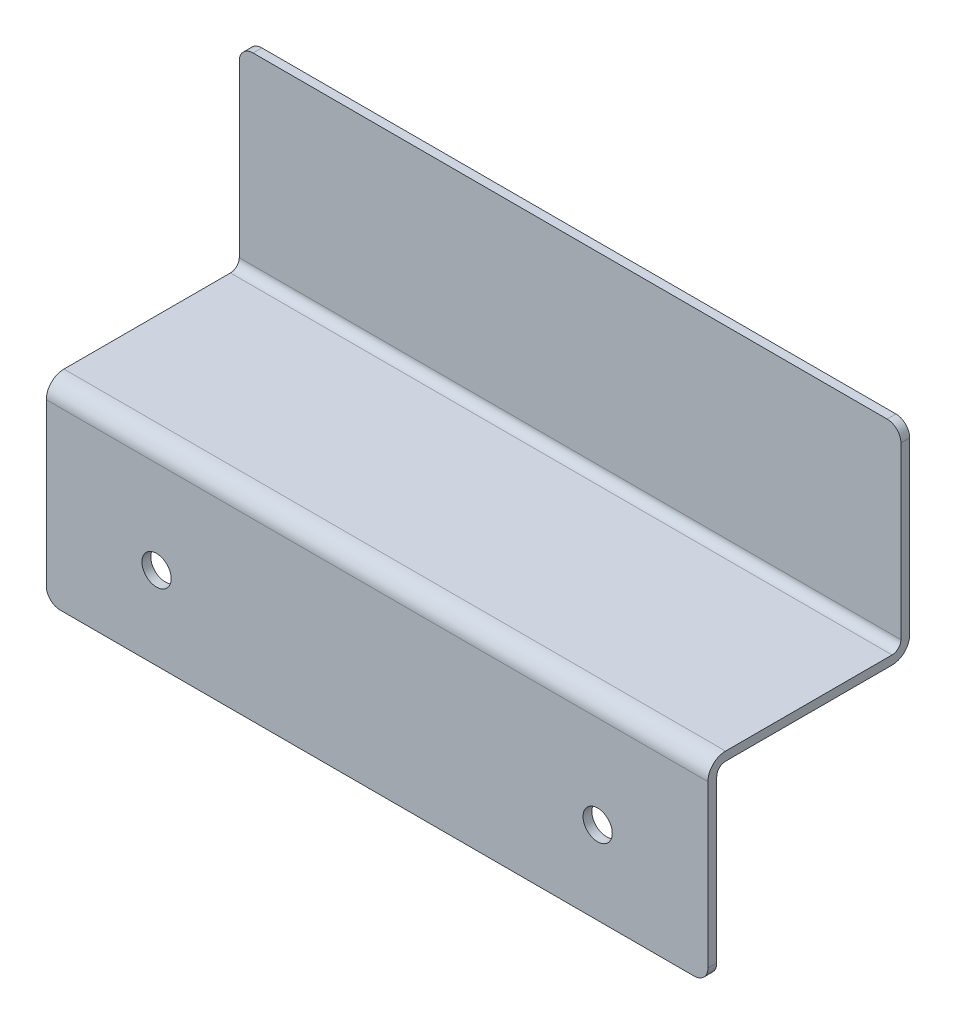
ISO-10303-21;
HEADER;
FILE_DESCRIPTION(('STEP AP214'),'2;1');
FILE_NAME('part.step','',(''),(''),'','','');
FILE_SCHEMA(('AUTOMOTIVE_DESIGN { 1 0 10303 214 1 1 1 1 }'));
ENDSEC;
DATA;
#1=APPLICATION_CONTEXT('core data for automotive mechanical design processes');
#2=APPLICATION_PROTOCOL_DEFINITION('international standard','automotive_design',2000,#1);
#3=PRODUCT_CONTEXT('',#1,'mechanical');
#4=PRODUCT('Part','Part','',(#3));
#5=PRODUCT_RELATED_PRODUCT_CATEGORY('part','',(#4));
#6=PRODUCT_DEFINITION_FORMATION('','',#4);
#7=PRODUCT_DEFINITION_CONTEXT('part definition',#1,'design');
#8=PRODUCT_DEFINITION('design','',#6,#7);
#9=PRODUCT_DEFINITION_SHAPE('','',#8);
#10=(LENGTH_UNIT() NAMED_UNIT(*) SI_UNIT(.MILLI.,.METRE.));
#11=(NAMED_UNIT(*) PLANE_ANGLE_UNIT() SI_UNIT($,.RADIAN.));
#12=(NAMED_UNIT(*) SI_UNIT($,.STERADIAN.) SOLID_ANGLE_UNIT());
#13=UNCERTAINTY_MEASURE_WITH_UNIT(LENGTH_MEASURE(1.E-05),#10,'distance_accuracy_value','');
#14=(GEOMETRIC_REPRESENTATION_CONTEXT(3) GLOBAL_UNCERTAINTY_ASSIGNED_CONTEXT((#13)) GLOBAL_UNIT_ASSIGNED_CONTEXT((#10,
#11,#12)) REPRESENTATION_CONTEXT('',''));
#15=CARTESIAN_POINT('',(0.,0.,0.));
#16=DIRECTION('',(0.,0.,1.));
#17=DIRECTION('',(1.,0.,0.));
#18=AXIS2_PLACEMENT_3D('',#15,#16,#17);
#19=CARTESIAN_POINT('',(152.4,0.,0.));
#20=DIRECTION('',(0.,-1.,0.));
#21=DIRECTION('',(0.,0.,-1.));
#22=AXIS2_PLACEMENT_3D('',#19,#20,#21);
#23=PLANE('',#22);
#24=DIRECTION('',(-1.,0.,0.));
#25=VECTOR('',#24,1.);
#26=CARTESIAN_POINT('',(152.4,0.,-2.032));
#27=LINE('',#26,#25);
#28=CARTESIAN_POINT('',(149.225,0.,-2.032));
#29=VERTEX_POINT('',#28);
#30=CARTESIAN_POINT('',(3.17500000000007,0.,-2.032));
#31=VERTEX_POINT('',#30);
#32=EDGE_CURVE('E189',#29,#31,#27,.T.);
#33=ORIENTED_EDGE('',*,*,#32,.T.);
#34=DIRECTION('',(0.,0.,1.));
#35=VECTOR('',#34,1.);
#36=CARTESIAN_POINT('',(3.17500000000001,0.,0.));
#37=LINE('',#36,#35);
#38=CARTESIAN_POINT('',(3.17500000000007,0.,0.));
#39=VERTEX_POINT('',#38);
#40=EDGE_CURVE('E249',#31,#39,#37,.T.);
#41=ORIENTED_EDGE('',*,*,#40,.T.);
#42=DIRECTION('',(-1.,0.,0.));
#43=VECTOR('',#42,1.);
#44=CARTESIAN_POINT('',(152.4,0.,0.));
#45=LINE('',#44,#43);
#46=CARTESIAN_POINT('',(149.225,0.,0.));
#47=VERTEX_POINT('',#46);
#48=EDGE_CURVE('E174',#47,#39,#45,.T.);
#49=ORIENTED_EDGE('',*,*,#48,.F.);
#50=DIRECTION('',(0.,0.,1.));
#51=VECTOR('',#50,1.);
#52=CARTESIAN_POINT('',(149.225,0.,0.));
#53=LINE('',#52,#51);
#54=EDGE_CURVE('E247',#47,#29,#53,.F.);
#55=ORIENTED_EDGE('',*,*,#54,.T.);
#56=EDGE_LOOP('',(#33,#41,#49,#55));
#57=FACE_BOUND('',#56,.T.);
#58=ADVANCED_FACE('F34',(#57),#23,.F.);
#59=CARTESIAN_POINT('',(152.4,0.,0.));
#60=DIRECTION('',(0.,0.,-1.));
#61=DIRECTION('',(0.,1.,0.));
#62=AXIS2_PLACEMENT_3D('',#59,#60,#61);
#63=PLANE('',#62);
#64=ORIENTED_EDGE('',*,*,#48,.T.);
#65=CARTESIAN_POINT('',(3.17500000000001,-3.175,0.));
#66=DIRECTION('',(0.,0.,-1.));
#67=DIRECTION('',(0.,1.,0.));
#68=AXIS2_PLACEMENT_3D('',#65,#66,#67);
#69=CIRCLE('',#68,3.175);
#70=CARTESIAN_POINT('',(0.,-3.175,0.));
#71=VERTEX_POINT('',#70);
#72=EDGE_CURVE('E253',#39,#71,#69,.F.);
#73=ORIENTED_EDGE('',*,*,#72,.T.);
#74=DIRECTION('',(0.,-1.,0.));
#75=VECTOR('',#74,1.);
#76=CARTESIAN_POINT('',(0.,0.,0.));
#77=LINE('',#76,#75);
#78=CARTESIAN_POINT('',(0.,-42.418,0.));
#79=VERTEX_POINT('',#78);
#80=EDGE_CURVE('E264',#71,#79,#77,.T.);
#81=ORIENTED_EDGE('',*,*,#80,.T.);
#82=DIRECTION('',(-1.,0.,0.));
#83=VECTOR('',#82,1.);
#84=CARTESIAN_POINT('',(152.4,-42.418,0.));
#85=LINE('',#84,#83);
#86=CARTESIAN_POINT('',(152.4,-42.418,0.));
#87=VERTEX_POINT('',#86);
#88=EDGE_CURVE('E164',#79,#87,#85,.F.);
#89=ORIENTED_EDGE('',*,*,#88,.T.);
#90=DIRECTION('',(0.,-1.,0.));
#91=VECTOR('',#90,1.);
#92=CARTESIAN_POINT('',(152.4,0.,0.));
#93=LINE('',#92,#91);
#94=CARTESIAN_POINT('',(152.4,-3.175,0.));
#95=VERTEX_POINT('',#94);
#96=EDGE_CURVE('E183',#95,#87,#93,.T.);
#97=ORIENTED_EDGE('',*,*,#96,.F.);
#98=CARTESIAN_POINT('',(149.225,-3.175,0.));
#99=DIRECTION('',(0.,0.,-1.));
#100=DIRECTION('',(0.,1.,0.));
#101=AXIS2_PLACEMENT_3D('',#98,#99,#100);
#102=CIRCLE('',#101,3.175);
#103=EDGE_CURVE('E59',#95,#47,#102,.F.);
#104=ORIENTED_EDGE('',*,*,#103,.T.);
#105=EDGE_LOOP('',(#64,#73,#81,#89,#97,#104));
#106=FACE_BOUND('',#105,.T.);
#107=ADVANCED_FACE('F336',(#106),#63,.F.);
#108=CARTESIAN_POINT('',(152.4,-44.45,0.));
#109=DIRECTION('',(0.,-1.,0.));
#110=DIRECTION('',(0.,0.,-1.));
#111=AXIS2_PLACEMENT_3D('',#108,#109,#110);
#112=PLANE('',#111);
#113=DIRECTION('',(0.,0.,1.));
#114=VECTOR('',#113,1.);
#115=CARTESIAN_POINT('',(0.,-44.45,0.));
#116=LINE('',#115,#114);
#117=CARTESIAN_POINT('',(0.,-44.45,2.03199999999999));
#118=VERTEX_POINT('',#117);
#119=CARTESIAN_POINT('',(0.,-44.45,40.386));
#120=VERTEX_POINT('',#119);
#121=EDGE_CURVE('E285',#118,#120,#116,.T.);
#122=ORIENTED_EDGE('',*,*,#121,.T.);
#123=DIRECTION('',(-1.,0.,0.));
#124=VECTOR('',#123,1.);
#125=CARTESIAN_POINT('',(152.4,-44.45,40.386));
#126=LINE('',#125,#124);
#127=CARTESIAN_POINT('',(152.4,-44.45,40.386));
#128=VERTEX_POINT('',#127);
#129=EDGE_CURVE('E219',#120,#128,#126,.F.);
#130=ORIENTED_EDGE('',*,*,#129,.T.);
#131=DIRECTION('',(0.,0.,1.));
#132=VECTOR('',#131,1.);
#133=CARTESIAN_POINT('',(152.4,-44.45,0.));
#134=LINE('',#133,#132);
#135=CARTESIAN_POINT('',(152.4,-44.45,2.03199999999999));
#136=VERTEX_POINT('',#135);
#137=EDGE_CURVE('E274',#136,#128,#134,.T.);
#138=ORIENTED_EDGE('',*,*,#137,.F.);
#139=DIRECTION('',(-1.,0.,0.));
#140=VECTOR('',#139,1.);
#141=CARTESIAN_POINT('',(0.,-44.45,2.03199999999999));
#142=LINE('',#141,#140);
#143=EDGE_CURVE('E202',#136,#118,#142,.T.);
#144=ORIENTED_EDGE('',*,*,#143,.T.);
#145=EDGE_LOOP('',(#122,#130,#138,#144));
#146=FACE_BOUND('',#145,.T.);
#147=ADVANCED_FACE('F318',(#146),#112,.F.);
#148=CARTESIAN_POINT('',(152.4,-44.45,44.45));
#149=DIRECTION('',(0.,0.,-1.));
#150=DIRECTION('',(0.,1.,0.));
#151=AXIS2_PLACEMENT_3D('',#148,#149,#150);
#152=PLANE('',#151);
#153=CARTESIAN_POINT('',(25.4,-69.85,44.45));
#154=DIRECTION('',(0.,0.,1.));
#155=DIRECTION('',(1.,0.,0.));
#156=AXIS2_PLACEMENT_3D('',#153,#154,#155);
#157=CIRCLE('',#156,3.3655);
#158=CARTESIAN_POINT('',(28.7655,-69.85,44.45));
#159=VERTEX_POINT('',#158);
#160=EDGE_CURVE('E260',#159,#159,#157,.T.);
#161=ORIENTED_EDGE('',*,*,#160,.F.);
#162=EDGE_LOOP('',(#161));
#163=FACE_BOUND('',#162,.T.);
#164=CARTESIAN_POINT('',(127.,-69.85,44.45));
#165=DIRECTION('',(0.,0.,1.));
#166=DIRECTION('',(1.,0.,0.));
#167=AXIS2_PLACEMENT_3D('',#164,#165,#166);
#168=CIRCLE('',#167,3.36549999999999);
#169=CARTESIAN_POINT('',(130.3655,-69.85,44.45));
#170=VERTEX_POINT('',#169);
#171=EDGE_CURVE('E266',#170,#170,#168,.T.);
#172=ORIENTED_EDGE('',*,*,#171,.F.);
#173=EDGE_LOOP('',(#172));
#174=FACE_BOUND('',#173,.T.);
#175=DIRECTION('',(0.,-1.,0.));
#176=VECTOR('',#175,1.);
#177=CARTESIAN_POINT('',(0.,-44.45,44.45));
#178=LINE('',#177,#176);
#179=CARTESIAN_POINT('',(0.,-48.514,44.45));
#180=VERTEX_POINT('',#179);
#181=CARTESIAN_POINT('',(0.,-85.725,44.45));
#182=VERTEX_POINT('',#181);
#183=EDGE_CURVE('E185',#180,#182,#178,.T.);
#184=ORIENTED_EDGE('',*,*,#183,.T.);
#185=CARTESIAN_POINT('',(3.17500000000001,-85.725,44.45));
#186=DIRECTION('',(0.,0.,-1.));
#187=DIRECTION('',(0.,1.,0.));
#188=AXIS2_PLACEMENT_3D('',#185,#186,#187);
#189=CIRCLE('',#188,3.175);
#190=CARTESIAN_POINT('',(3.17500000000007,-88.9,44.45));
#191=VERTEX_POINT('',#190);
#192=EDGE_CURVE('E245',#182,#191,#189,.F.);
#193=ORIENTED_EDGE('',*,*,#192,.T.);
#194=DIRECTION('',(-1.,0.,0.));
#195=VECTOR('',#194,1.);
#196=CARTESIAN_POINT('',(152.4,-88.9,44.45));
#197=LINE('',#196,#195);
#198=CARTESIAN_POINT('',(149.225,-88.9,44.45));
#199=VERTEX_POINT('',#198);
#200=EDGE_CURVE('E196',#199,#191,#197,.T.);
#201=ORIENTED_EDGE('',*,*,#200,.F.);
#202=CARTESIAN_POINT('',(149.225,-85.725,44.45));
#203=DIRECTION('',(0.,0.,-1.));
#204=DIRECTION('',(0.,1.,0.));
#205=AXIS2_PLACEMENT_3D('',#202,#203,#204);
#206=CIRCLE('',#205,3.175);
#207=CARTESIAN_POINT('',(152.4,-85.725,44.45));
#208=VERTEX_POINT('',#207);
#209=EDGE_CURVE('E243',#199,#208,#206,.F.);
#210=ORIENTED_EDGE('',*,*,#209,.T.);
#211=DIRECTION('',(0.,-1.,0.));
#212=VECTOR('',#211,1.);
#213=CARTESIAN_POINT('',(152.4,-44.45,44.45));
#214=LINE('',#213,#212);
#215=CARTESIAN_POINT('',(152.4,-48.514,44.45));
#216=VERTEX_POINT('',#215);
#217=EDGE_CURVE('E277',#216,#208,#214,.T.);
#218=ORIENTED_EDGE('',*,*,#217,.F.);
#219=DIRECTION('',(-1.,0.,0.));
#220=VECTOR('',#219,1.);
#221=CARTESIAN_POINT('',(152.4,-48.514,44.45));
#222=LINE('',#221,#220);
#223=EDGE_CURVE('E213',#216,#180,#222,.T.);
#224=ORIENTED_EDGE('',*,*,#223,.T.);
#225=EDGE_LOOP('',(#184,#193,#201,#210,#218,#224));
#226=FACE_BOUND('',#225,.T.);
#227=ADVANCED_FACE('F291',(#163,#174,#226),#152,.F.);
#228=CARTESIAN_POINT('',(152.4,-88.9,44.45));
#229=DIRECTION('',(0.,1.,0.));
#230=DIRECTION('',(0.,0.,1.));
#231=AXIS2_PLACEMENT_3D('',#228,#229,#230);
#232=PLANE('',#231);
#233=ORIENTED_EDGE('',*,*,#200,.T.);
#234=DIRECTION('',(0.,0.,-1.));
#235=VECTOR('',#234,1.);
#236=CARTESIAN_POINT('',(3.17500000000001,-88.9,42.418));
#237=LINE('',#236,#235);
#238=CARTESIAN_POINT('',(3.17500000000007,-88.9,42.418));
#239=VERTEX_POINT('',#238);
#240=EDGE_CURVE('E232',#191,#239,#237,.T.);
#241=ORIENTED_EDGE('',*,*,#240,.T.);
#242=DIRECTION('',(-1.,0.,0.));
#243=VECTOR('',#242,1.);
#244=CARTESIAN_POINT('',(152.4,-88.9,42.418));
#245=LINE('',#244,#243);
#246=CARTESIAN_POINT('',(149.225,-88.9,42.418));
#247=VERTEX_POINT('',#246);
#248=EDGE_CURVE('E192',#247,#239,#245,.T.);
#249=ORIENTED_EDGE('',*,*,#248,.F.);
#250=DIRECTION('',(0.,0.,-1.));
#251=VECTOR('',#250,1.);
#252=CARTESIAN_POINT('',(149.225,-88.9,44.45));
#253=LINE('',#252,#251);
#254=EDGE_CURVE('E230',#247,#199,#253,.F.);
#255=ORIENTED_EDGE('',*,*,#254,.T.);
#256=EDGE_LOOP('',(#233,#241,#249,#255));
#257=FACE_BOUND('',#256,.T.);
#258=ADVANCED_FACE('F301',(#257),#232,.F.);
#259=CARTESIAN_POINT('',(152.4,-46.482,42.418));
#260=DIRECTION('',(0.,0.,1.));
#261=DIRECTION('',(0.,-1.,0.));
#262=AXIS2_PLACEMENT_3D('',#259,#260,#261);
#263=PLANE('',#262);
#264=CARTESIAN_POINT('',(25.4,-69.85,42.418));
#265=DIRECTION('',(0.,0.,1.));
#266=DIRECTION('',(0.,-1.,0.));
#267=AXIS2_PLACEMENT_3D('',#264,#265,#266);
#268=CIRCLE('',#267,3.3655);
#269=CARTESIAN_POINT('',(25.4,-73.2155,42.418));
#270=VERTEX_POINT('',#269);
#271=EDGE_CURVE('E38',#270,#270,#268,.T.);
#272=ORIENTED_EDGE('',*,*,#271,.T.);
#273=EDGE_LOOP('',(#272));
#274=FACE_BOUND('',#273,.T.);
#275=CARTESIAN_POINT('',(127.,-69.85,42.418));
#276=DIRECTION('',(0.,0.,1.));
#277=DIRECTION('',(0.,-1.,0.));
#278=AXIS2_PLACEMENT_3D('',#275,#276,#277);
#279=CIRCLE('',#278,3.36549999999999);
#280=CARTESIAN_POINT('',(127.,-73.2155,42.418));
#281=VERTEX_POINT('',#280);
#282=EDGE_CURVE('E258',#281,#281,#279,.T.);
#283=ORIENTED_EDGE('',*,*,#282,.T.);
#284=EDGE_LOOP('',(#283));
#285=FACE_BOUND('',#284,.T.);
#286=ORIENTED_EDGE('',*,*,#248,.T.);
#287=CARTESIAN_POINT('',(3.17500000000001,-85.725,42.418));
#288=DIRECTION('',(0.,0.,1.));
#289=DIRECTION('',(0.,-1.,0.));
#290=AXIS2_PLACEMENT_3D('',#287,#288,#289);
#291=CIRCLE('',#290,3.175);
#292=CARTESIAN_POINT('',(0.,-85.725,42.418));
#293=VERTEX_POINT('',#292);
#294=EDGE_CURVE('E237',#239,#293,#291,.F.);
#295=ORIENTED_EDGE('',*,*,#294,.T.);
#296=DIRECTION('',(0.,1.,0.));
#297=VECTOR('',#296,1.);
#298=CARTESIAN_POINT('',(0.,-46.482,42.418));
#299=LINE('',#298,#297);
#300=CARTESIAN_POINT('',(0.,-48.514,42.418));
#301=VERTEX_POINT('',#300);
#302=EDGE_CURVE('E180',#293,#301,#299,.T.);
#303=ORIENTED_EDGE('',*,*,#302,.T.);
#304=DIRECTION('',(-1.,0.,0.));
#305=VECTOR('',#304,1.);
#306=CARTESIAN_POINT('',(152.4,-48.514,42.418));
#307=LINE('',#306,#305);
#308=CARTESIAN_POINT('',(152.4,-48.514,42.418));
#309=VERTEX_POINT('',#308);
#310=EDGE_CURVE('E159',#301,#309,#307,.F.);
#311=ORIENTED_EDGE('',*,*,#310,.T.);
#312=DIRECTION('',(0.,1.,0.));
#313=VECTOR('',#312,1.);
#314=CARTESIAN_POINT('',(152.4,-46.482,42.418));
#315=LINE('',#314,#313);
#316=CARTESIAN_POINT('',(152.4,-85.725,42.418));
#317=VERTEX_POINT('',#316);
#318=EDGE_CURVE('E280',#317,#309,#315,.T.);
#319=ORIENTED_EDGE('',*,*,#318,.F.);
#320=CARTESIAN_POINT('',(149.225,-85.725,42.418));
#321=DIRECTION('',(0.,0.,1.));
#322=DIRECTION('',(0.,-1.,0.));
#323=AXIS2_PLACEMENT_3D('',#320,#321,#322);
#324=CIRCLE('',#323,3.175);
#325=EDGE_CURVE('E235',#317,#247,#324,.F.);
#326=ORIENTED_EDGE('',*,*,#325,.T.);
#327=EDGE_LOOP('',(#286,#295,#303,#311,#319,#326));
#328=FACE_BOUND('',#327,.T.);
#329=ADVANCED_FACE('F304',(#274,#285,#328),#263,.F.);
#330=CARTESIAN_POINT('',(152.4,-46.482,-2.03200000000001));
#331=DIRECTION('',(0.,1.,0.));
#332=DIRECTION('',(0.,0.,1.));
#333=AXIS2_PLACEMENT_3D('',#330,#331,#332);
#334=PLANE('',#333);
#335=DIRECTION('',(0.,0.,-1.));
#336=VECTOR('',#335,1.);
#337=CARTESIAN_POINT('',(0.,-46.482,-2.03200000000001));
#338=LINE('',#337,#336);
#339=CARTESIAN_POINT('',(0.,-46.482,40.386));
#340=VERTEX_POINT('',#339);
#341=CARTESIAN_POINT('',(0.,-46.482,2.03199999999999));
#342=VERTEX_POINT('',#341);
#343=EDGE_CURVE('E170',#340,#342,#338,.T.);
#344=ORIENTED_EDGE('',*,*,#343,.T.);
#345=DIRECTION('',(-1.,0.,0.));
#346=VECTOR('',#345,1.);
#347=CARTESIAN_POINT('',(152.4,-46.482,2.03199999999999));
#348=LINE('',#347,#346);
#349=CARTESIAN_POINT('',(152.4,-46.482,2.03199999999999));
#350=VERTEX_POINT('',#349);
#351=EDGE_CURVE('E228',#342,#350,#348,.F.);
#352=ORIENTED_EDGE('',*,*,#351,.T.);
#353=DIRECTION('',(0.,0.,-1.));
#354=VECTOR('',#353,1.);
#355=CARTESIAN_POINT('',(152.4,-46.482,-2.03200000000001));
#356=LINE('',#355,#354);
#357=CARTESIAN_POINT('',(152.4,-46.482,40.386));
#358=VERTEX_POINT('',#357);
#359=EDGE_CURVE('E173',#358,#350,#356,.T.);
#360=ORIENTED_EDGE('',*,*,#359,.F.);
#361=DIRECTION('',(-1.,0.,0.));
#362=VECTOR('',#361,1.);
#363=CARTESIAN_POINT('',(0.,-46.482,40.386));
#364=LINE('',#363,#362);
#365=EDGE_CURVE('E157',#358,#340,#364,.T.);
#366=ORIENTED_EDGE('',*,*,#365,.T.);
#367=EDGE_LOOP('',(#344,#352,#360,#366));
#368=FACE_BOUND('',#367,.T.);
#369=ADVANCED_FACE('F169',(#368),#334,.F.);
#370=CARTESIAN_POINT('',(152.4,0.,-2.032));
#371=DIRECTION('',(0.,0.,1.));
#372=DIRECTION('',(0.,-1.,0.));
#373=AXIS2_PLACEMENT_3D('',#370,#371,#372);
#374=PLANE('',#373);
#375=DIRECTION('',(0.,1.,0.));
#376=VECTOR('',#375,1.);
#377=CARTESIAN_POINT('',(0.,0.,-2.032));
#378=LINE('',#377,#376);
#379=CARTESIAN_POINT('',(0.,-42.418,-2.03200000000001));
#380=VERTEX_POINT('',#379);
#381=CARTESIAN_POINT('',(0.,-3.175,-2.032));
#382=VERTEX_POINT('',#381);
#383=EDGE_CURVE('E179',#380,#382,#378,.T.);
#384=ORIENTED_EDGE('',*,*,#383,.T.);
#385=CARTESIAN_POINT('',(3.17500000000001,-3.175,-2.032));
#386=DIRECTION('',(0.,0.,1.));
#387=DIRECTION('',(0.,-1.,0.));
#388=AXIS2_PLACEMENT_3D('',#385,#386,#387);
#389=CIRCLE('',#388,3.175);
#390=EDGE_CURVE('E256',#382,#31,#389,.F.);
#391=ORIENTED_EDGE('',*,*,#390,.T.);
#392=ORIENTED_EDGE('',*,*,#32,.F.);
#393=CARTESIAN_POINT('',(149.225,-3.175,-2.032));
#394=DIRECTION('',(0.,0.,1.));
#395=DIRECTION('',(0.,-1.,0.));
#396=AXIS2_PLACEMENT_3D('',#393,#394,#395);
#397=CIRCLE('',#396,3.175);
#398=CARTESIAN_POINT('',(152.4,-3.175,-2.032));
#399=VERTEX_POINT('',#398);
#400=EDGE_CURVE('E51',#29,#399,#397,.F.);
#401=ORIENTED_EDGE('',*,*,#400,.T.);
#402=DIRECTION('',(0.,1.,0.));
#403=VECTOR('',#402,1.);
#404=CARTESIAN_POINT('',(152.4,0.,-2.032));
#405=LINE('',#404,#403);
#406=CARTESIAN_POINT('',(152.4,-42.418,-2.03200000000001));
#407=VERTEX_POINT('',#406);
#408=EDGE_CURVE('E193',#407,#399,#405,.T.);
#409=ORIENTED_EDGE('',*,*,#408,.F.);
#410=DIRECTION('',(-1.,0.,0.));
#411=VECTOR('',#410,1.);
#412=CARTESIAN_POINT('',(152.4,-42.418,-2.03200000000001));
#413=LINE('',#412,#411);
#414=EDGE_CURVE('E225',#407,#380,#413,.T.);
#415=ORIENTED_EDGE('',*,*,#414,.T.);
#416=EDGE_LOOP('',(#384,#391,#392,#401,#409,#415));
#417=FACE_BOUND('',#416,.T.);
#418=ADVANCED_FACE('F332',(#417),#374,.F.);
#419=CARTESIAN_POINT('',(152.4,0.,0.));
#420=DIRECTION('',(-1.,0.,0.));
#421=DIRECTION('',(0.,0.,1.));
#422=AXIS2_PLACEMENT_3D('',#419,#420,#421);
#423=PLANE('',#422);
#424=ORIENTED_EDGE('',*,*,#217,.T.);
#425=DIRECTION('',(0.,0.,-1.));
#426=VECTOR('',#425,1.);
#427=CARTESIAN_POINT('',(152.4,-85.725,0.));
#428=LINE('',#427,#426);
#429=EDGE_CURVE('E11',#208,#317,#428,.T.);
#430=ORIENTED_EDGE('',*,*,#429,.T.);
#431=ORIENTED_EDGE('',*,*,#318,.T.);
#432=CARTESIAN_POINT('',(152.4,-48.514,40.386));
#433=DIRECTION('',(-1.,0.,0.));
#434=DIRECTION('',(0.,0.,1.));
#435=AXIS2_PLACEMENT_3D('',#432,#433,#434);
#436=CIRCLE('',#435,2.032);
#437=EDGE_CURVE('E163',#309,#358,#436,.T.);
#438=ORIENTED_EDGE('',*,*,#437,.T.);
#439=ORIENTED_EDGE('',*,*,#359,.T.);
#440=CARTESIAN_POINT('',(152.4,-42.418,2.03199999999999));
#441=DIRECTION('',(-1.,0.,0.));
#442=DIRECTION('',(0.,0.,1.));
#443=AXIS2_PLACEMENT_3D('',#440,#441,#442);
#444=CIRCLE('',#443,4.064);
#445=EDGE_CURVE('E221',#350,#407,#444,.F.);
#446=ORIENTED_EDGE('',*,*,#445,.T.);
#447=ORIENTED_EDGE('',*,*,#408,.T.);
#448=DIRECTION('',(0.,0.,1.));
#449=VECTOR('',#448,1.);
#450=CARTESIAN_POINT('',(152.4,-3.175,0.));
#451=LINE('',#450,#449);
#452=EDGE_CURVE('E43',#399,#95,#451,.T.);
#453=ORIENTED_EDGE('',*,*,#452,.T.);
#454=ORIENTED_EDGE('',*,*,#96,.T.);
#455=CARTESIAN_POINT('',(152.4,-42.418,2.03199999999999));
#456=DIRECTION('',(-1.,0.,0.));
#457=DIRECTION('',(0.,0.,1.));
#458=AXIS2_PLACEMENT_3D('',#455,#456,#457);
#459=CIRCLE('',#458,2.032);
#460=EDGE_CURVE('E211',#87,#136,#459,.T.);
#461=ORIENTED_EDGE('',*,*,#460,.T.);
#462=ORIENTED_EDGE('',*,*,#137,.T.);
#463=CARTESIAN_POINT('',(152.4,-48.514,40.386));
#464=DIRECTION('',(-1.,0.,0.));
#465=DIRECTION('',(0.,0.,1.));
#466=AXIS2_PLACEMENT_3D('',#463,#464,#465);
#467=CIRCLE('',#466,4.064);
#468=EDGE_CURVE('E223',#128,#216,#467,.F.);
#469=ORIENTED_EDGE('',*,*,#468,.T.);
#470=EDGE_LOOP('',(#424,#430,#431,#438,#439,#446,#447,#453,#454,#461,#462,#469));
#471=FACE_BOUND('',#470,.T.);
#472=ADVANCED_FACE('F311',(#471),#423,.F.);
#473=CARTESIAN_POINT('',(0.,0.,0.));
#474=DIRECTION('',(-1.,0.,0.));
#475=DIRECTION('',(0.,0.,1.));
#476=AXIS2_PLACEMENT_3D('',#473,#474,#475);
#477=PLANE('',#476);
#478=ORIENTED_EDGE('',*,*,#302,.F.);
#479=DIRECTION('',(0.,0.,-1.));
#480=VECTOR('',#479,1.);
#481=CARTESIAN_POINT('',(0.,-85.725,44.45));
#482=LINE('',#481,#480);
#483=EDGE_CURVE('E241',#293,#182,#482,.F.);
#484=ORIENTED_EDGE('',*,*,#483,.T.);
#485=ORIENTED_EDGE('',*,*,#183,.F.);
#486=CARTESIAN_POINT('',(0.,-48.514,40.386));
#487=DIRECTION('',(-1.,0.,0.));
#488=DIRECTION('',(0.,0.,1.));
#489=AXIS2_PLACEMENT_3D('',#486,#487,#488);
#490=CIRCLE('',#489,4.064);
#491=EDGE_CURVE('E217',#180,#120,#490,.T.);
#492=ORIENTED_EDGE('',*,*,#491,.T.);
#493=ORIENTED_EDGE('',*,*,#121,.F.);
#494=CARTESIAN_POINT('',(0.,-42.418,2.03199999999999));
#495=DIRECTION('',(-1.,0.,0.));
#496=DIRECTION('',(0.,0.,1.));
#497=AXIS2_PLACEMENT_3D('',#494,#495,#496);
#498=CIRCLE('',#497,2.032);
#499=EDGE_CURVE('E208',#118,#79,#498,.F.);
#500=ORIENTED_EDGE('',*,*,#499,.T.);
#501=ORIENTED_EDGE('',*,*,#80,.F.);
#502=DIRECTION('',(0.,0.,1.));
#503=VECTOR('',#502,1.);
#504=CARTESIAN_POINT('',(0.,-3.175,-2.032));
#505=LINE('',#504,#503);
#506=EDGE_CURVE('E239',#71,#382,#505,.F.);
#507=ORIENTED_EDGE('',*,*,#506,.T.);
#508=ORIENTED_EDGE('',*,*,#383,.F.);
#509=CARTESIAN_POINT('',(0.,-42.418,2.03199999999999));
#510=DIRECTION('',(-1.,0.,0.));
#511=DIRECTION('',(0.,0.,1.));
#512=AXIS2_PLACEMENT_3D('',#509,#510,#511);
#513=CIRCLE('',#512,4.064);
#514=EDGE_CURVE('E178',#380,#342,#513,.T.);
#515=ORIENTED_EDGE('',*,*,#514,.T.);
#516=ORIENTED_EDGE('',*,*,#343,.F.);
#517=CARTESIAN_POINT('',(0.,-48.514,40.386));
#518=DIRECTION('',(-1.,0.,0.));
#519=DIRECTION('',(0.,0.,1.));
#520=AXIS2_PLACEMENT_3D('',#517,#518,#519);
#521=CIRCLE('',#520,2.032);
#522=EDGE_CURVE('E153',#340,#301,#521,.F.);
#523=ORIENTED_EDGE('',*,*,#522,.T.);
#524=EDGE_LOOP('',(#478,#484,#485,#492,#493,#500,#501,#507,#508,#515,#516,#523));
#525=FACE_BOUND('',#524,.T.);
#526=ADVANCED_FACE('F176',(#525),#477,.T.);
#527=CARTESIAN_POINT('',(152.4,-48.514,40.386));
#528=DIRECTION('',(1.,0.,0.));
#529=DIRECTION('',(0.,0.,-1.));
#530=AXIS2_PLACEMENT_3D('',#527,#528,#529);
#531=CYLINDRICAL_SURFACE('',#530,2.032);
#532=ORIENTED_EDGE('',*,*,#437,.F.);
#533=ORIENTED_EDGE('',*,*,#310,.F.);
#534=ORIENTED_EDGE('',*,*,#522,.F.);
#535=ORIENTED_EDGE('',*,*,#365,.F.);
#536=EDGE_LOOP('',(#532,#533,#534,#535));
#537=FACE_BOUND('',#536,.T.);
#538=ADVANCED_FACE('F156',(#537),#531,.F.);
#539=CARTESIAN_POINT('',(152.4,-42.418,2.03199999999999));
#540=DIRECTION('',(1.,0.,0.));
#541=DIRECTION('',(0.,0.,-1.));
#542=AXIS2_PLACEMENT_3D('',#539,#540,#541);
#543=CYLINDRICAL_SURFACE('',#542,2.032);
#544=ORIENTED_EDGE('',*,*,#460,.F.);
#545=ORIENTED_EDGE('',*,*,#88,.F.);
#546=ORIENTED_EDGE('',*,*,#499,.F.);
#547=ORIENTED_EDGE('',*,*,#143,.F.);
#548=EDGE_LOOP('',(#544,#545,#546,#547));
#549=FACE_BOUND('',#548,.T.);
#550=ADVANCED_FACE('F323',(#549),#543,.F.);
#551=CARTESIAN_POINT('',(152.4,-48.514,40.386));
#552=DIRECTION('',(-1.,0.,0.));
#553=DIRECTION('',(0.,0.,1.));
#554=AXIS2_PLACEMENT_3D('',#551,#552,#553);
#555=CYLINDRICAL_SURFACE('',#554,4.064);
#556=ORIENTED_EDGE('',*,*,#468,.F.);
#557=ORIENTED_EDGE('',*,*,#129,.F.);
#558=ORIENTED_EDGE('',*,*,#491,.F.);
#559=ORIENTED_EDGE('',*,*,#223,.F.);
#560=EDGE_LOOP('',(#556,#557,#558,#559));
#561=FACE_BOUND('',#560,.T.);
#562=ADVANCED_FACE('F314',(#561),#555,.T.);
#563=CARTESIAN_POINT('',(152.4,-42.418,2.03199999999999));
#564=DIRECTION('',(-1.,0.,0.));
#565=DIRECTION('',(0.,0.,1.));
#566=AXIS2_PLACEMENT_3D('',#563,#564,#565);
#567=CYLINDRICAL_SURFACE('',#566,4.064);
#568=ORIENTED_EDGE('',*,*,#445,.F.);
#569=ORIENTED_EDGE('',*,*,#351,.F.);
#570=ORIENTED_EDGE('',*,*,#514,.F.);
#571=ORIENTED_EDGE('',*,*,#414,.F.);
#572=EDGE_LOOP('',(#568,#569,#570,#571));
#573=FACE_BOUND('',#572,.T.);
#574=ADVANCED_FACE('F353',(#573),#567,.T.);
#575=CARTESIAN_POINT('',(3.17500000000001,-85.725,44.45));
#576=DIRECTION('',(0.,0.,1.));
#577=DIRECTION('',(1.,0.,0.));
#578=AXIS2_PLACEMENT_3D('',#575,#576,#577);
#579=CYLINDRICAL_SURFACE('',#578,3.175);
#580=ORIENTED_EDGE('',*,*,#192,.F.);
#581=ORIENTED_EDGE('',*,*,#483,.F.);
#582=ORIENTED_EDGE('',*,*,#294,.F.);
#583=ORIENTED_EDGE('',*,*,#240,.F.);
#584=EDGE_LOOP('',(#580,#581,#582,#583));
#585=FACE_BOUND('',#584,.T.);
#586=ADVANCED_FACE('F298',(#585),#579,.T.);
#587=CARTESIAN_POINT('',(3.17500000000001,-3.175,0.));
#588=DIRECTION('',(0.,0.,-1.));
#589=DIRECTION('',(-1.,0.,0.));
#590=AXIS2_PLACEMENT_3D('',#587,#588,#589);
#591=CYLINDRICAL_SURFACE('',#590,3.175);
#592=ORIENTED_EDGE('',*,*,#390,.F.);
#593=ORIENTED_EDGE('',*,*,#506,.F.);
#594=ORIENTED_EDGE('',*,*,#72,.F.);
#595=ORIENTED_EDGE('',*,*,#40,.F.);
#596=EDGE_LOOP('',(#592,#593,#594,#595));
#597=FACE_BOUND('',#596,.T.);
#598=ADVANCED_FACE('F330',(#597),#591,.T.);
#599=CARTESIAN_POINT('',(149.225,-85.725,0.));
#600=DIRECTION('',(0.,0.,-1.));
#601=DIRECTION('',(-1.,0.,0.));
#602=AXIS2_PLACEMENT_3D('',#599,#600,#601);
#603=CYLINDRICAL_SURFACE('',#602,3.175);
#604=ORIENTED_EDGE('',*,*,#209,.F.);
#605=ORIENTED_EDGE('',*,*,#254,.F.);
#606=ORIENTED_EDGE('',*,*,#325,.F.);
#607=ORIENTED_EDGE('',*,*,#429,.F.);
#608=EDGE_LOOP('',(#604,#605,#606,#607));
#609=FACE_BOUND('',#608,.T.);
#610=ADVANCED_FACE('F309',(#609),#603,.T.);
#611=CARTESIAN_POINT('',(149.225,-3.175,0.));
#612=DIRECTION('',(0.,0.,1.));
#613=DIRECTION('',(1.,0.,0.));
#614=AXIS2_PLACEMENT_3D('',#611,#612,#613);
#615=CYLINDRICAL_SURFACE('',#614,3.175);
#616=ORIENTED_EDGE('',*,*,#400,.F.);
#617=ORIENTED_EDGE('',*,*,#54,.F.);
#618=ORIENTED_EDGE('',*,*,#103,.F.);
#619=ORIENTED_EDGE('',*,*,#452,.F.);
#620=EDGE_LOOP('',(#616,#617,#618,#619));
#621=FACE_BOUND('',#620,.T.);
#622=ADVANCED_FACE('F36',(#621),#615,.T.);
#623=CARTESIAN_POINT('',(127.,-69.85,-2.03200000000001));
#624=DIRECTION('',(0.,0.,1.));
#625=DIRECTION('',(1.,0.,0.));
#626=AXIS2_PLACEMENT_3D('',#623,#624,#625);
#627=CYLINDRICAL_SURFACE('',#626,3.36549999999999);
#628=ORIENTED_EDGE('',*,*,#171,.T.);
#629=EDGE_LOOP('',(#628));
#630=FACE_BOUND('',#629,.T.);
#631=ORIENTED_EDGE('',*,*,#282,.F.);
#632=EDGE_LOOP('',(#631));
#633=FACE_BOUND('',#632,.T.);
#634=ADVANCED_FACE('F364',(#630,#633),#627,.F.);
#635=CARTESIAN_POINT('',(25.4,-69.85,-2.03200000000001));
#636=DIRECTION('',(0.,0.,1.));
#637=DIRECTION('',(1.,0.,0.));
#638=AXIS2_PLACEMENT_3D('',#635,#636,#637);
#639=CYLINDRICAL_SURFACE('',#638,3.3655);
#640=ORIENTED_EDGE('',*,*,#160,.T.);
#641=EDGE_LOOP('',(#640));
#642=FACE_BOUND('',#641,.T.);
#643=ORIENTED_EDGE('',*,*,#271,.F.);
#644=EDGE_LOOP('',(#643));
#645=FACE_BOUND('',#644,.T.);
#646=ADVANCED_FACE('F368',(#642,#645),#639,.F.);
#647=CLOSED_SHELL('',(#58,#107,#147,#227,#258,#329,#369,#418,#472,#526,#538,#550,#562,#574,#586,
#598,#610,#622,#634,#646));
#648=MANIFOLD_SOLID_BREP('B2',#647);
#649=ADVANCED_BREP_SHAPE_REPRESENTATION('',(#18,#648),#14);
#650=SHAPE_DEFINITION_REPRESENTATION(#9,#649);
ENDSEC;
END-ISO-10303-21;
